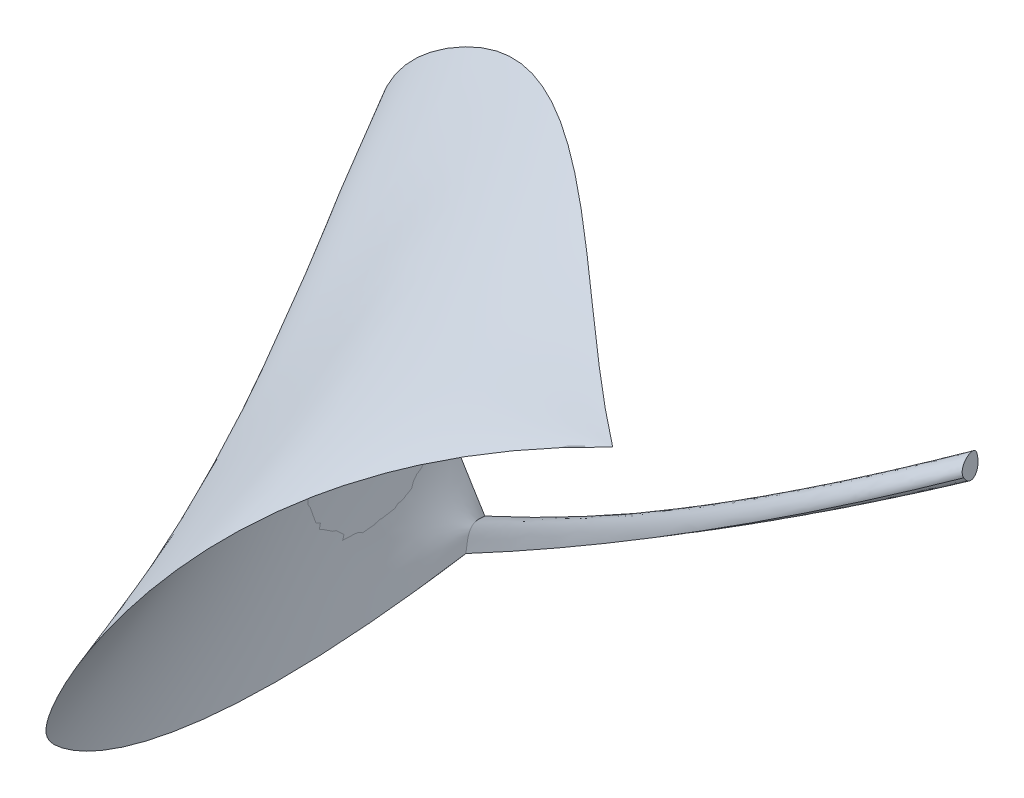
ISO-10303-21;
HEADER;
FILE_DESCRIPTION(('STEP AP214'),'2;1');
FILE_NAME('part.step','',(''),(''),'','','');
FILE_SCHEMA(('AUTOMOTIVE_DESIGN { 1 0 10303 214 1 1 1 1 }'));
ENDSEC;
DATA;
#1=APPLICATION_CONTEXT('core data for automotive mechanical design processes');
#2=APPLICATION_PROTOCOL_DEFINITION('international standard','automotive_design',2000,#1);
#3=PRODUCT_CONTEXT('',#1,'mechanical');
#4=PRODUCT('Part','Part','',(#3));
#5=PRODUCT_RELATED_PRODUCT_CATEGORY('part','',(#4));
#6=PRODUCT_DEFINITION_FORMATION('','',#4);
#7=PRODUCT_DEFINITION_CONTEXT('part definition',#1,'design');
#8=PRODUCT_DEFINITION('design','',#6,#7);
#9=PRODUCT_DEFINITION_SHAPE('','',#8);
#10=(LENGTH_UNIT() NAMED_UNIT(*) SI_UNIT(.MILLI.,.METRE.));
#11=(NAMED_UNIT(*) PLANE_ANGLE_UNIT() SI_UNIT($,.RADIAN.));
#12=(NAMED_UNIT(*) SI_UNIT($,.STERADIAN.) SOLID_ANGLE_UNIT());
#13=UNCERTAINTY_MEASURE_WITH_UNIT(LENGTH_MEASURE(1.E-05),#10,'distance_accuracy_value','');
#14=(GEOMETRIC_REPRESENTATION_CONTEXT(3) GLOBAL_UNCERTAINTY_ASSIGNED_CONTEXT((#13)) GLOBAL_UNIT_ASSIGNED_CONTEXT((#10,
#11,#12)) REPRESENTATION_CONTEXT('',''));
#15=CARTESIAN_POINT('',(0.,0.,0.));
#16=DIRECTION('',(0.,0.,1.));
#17=DIRECTION('',(1.,0.,0.));
#18=AXIS2_PLACEMENT_3D('',#15,#16,#17);
#19=CARTESIAN_POINT('',(476.173938751222,483.390649414063,2912.85863647461));
#20=CARTESIAN_POINT('',(468.505709833386,484.203110736505,2907.15012274566));
#21=CARTESIAN_POINT('',(453.033481909104,485.837551941291,2895.33620770903));
#22=CARTESIAN_POINT('',(413.746130360141,489.888925090577,2864.05863449965));
#23=CARTESIAN_POINT('',(357.24664169793,495.233100429992,2816.06685864888));
#24=CARTESIAN_POINT('',(299.472334646735,499.112690307353,2764.97149674455));
#25=CARTESIAN_POINT('',(258.0602857828,500.723087686551,2728.52128011258));
#26=CARTESIAN_POINT('',(224.932607896236,501.494553593436,2699.57399809323));
#27=CARTESIAN_POINT('',(183.638880068602,501.391244675883,2664.15338506051));
#28=CARTESIAN_POINT('',(142.761434191307,499.650929551684,2630.59425964772));
#29=CARTESIAN_POINT('',(110.46632020542,497.148383045274,2605.36995286823));
#30=CARTESIAN_POINT('',(78.4864498025541,493.874200141388,2581.36767607761));
#31=CARTESIAN_POINT('',(39.1852218403628,488.275703029805,2553.9187006092));
#32=CARTESIAN_POINT('',(0.953834645265467,480.566643990647,2530.41320071608));
#33=CARTESIAN_POINT('',(-28.8863542234126,473.07133723161,2514.29787507606));
#34=CARTESIAN_POINT('',(-56.3730886695851,465.205160417476,2500.94021452222));
#35=CARTESIAN_POINT('',(-88.5135090300193,454.365531427592,2487.91442288324));
#36=CARTESIAN_POINT('',(-114.351825196399,443.83714417721,2480.39678925414));
#37=CARTESIAN_POINT('',(-129.51334872772,437.003889742522,2477.08242398293));
#38=CARTESIAN_POINT('',(-142.052251947714,431.209692279449,2474.55640005456));
#39=CARTESIAN_POINT('',(-161.673827046332,421.377449022925,2471.63189144479));
#40=CARTESIAN_POINT('',(-179.54385515046,411.018525402232,2470.01286469059));
#41=CARTESIAN_POINT('',(-189.299999342797,404.857033905543,2469.26934460274));
#42=CARTESIAN_POINT('',(-199.008037796242,398.63548770122,2468.55118801729));
#43=CARTESIAN_POINT('',(-215.460220647931,387.138035879024,2467.52807505389));
#44=CARTESIAN_POINT('',(-231.786373332711,373.597734733701,2466.33827430998));
#45=CARTESIAN_POINT('',(-242.142332427982,363.921554121519,2465.25085156375));
#46=CARTESIAN_POINT('',(-249.227535176112,356.954046877819,2464.40066239642));
#47=CARTESIAN_POINT('',(-257.663767860382,347.995832185281,2463.18608081423));
#48=CARTESIAN_POINT('',(-272.38362987903,330.707784822725,2460.58869137601));
#49=CARTESIAN_POINT('',(-289.848760157672,305.969585880149,2456.36098661491));
#50=CARTESIAN_POINT('',(-307.441547822391,272.895625026125,2450.18457020366));
#51=CARTESIAN_POINT('',(-320.712504764034,238.514388582167,2443.62687976982));
#52=CARTESIAN_POINT('',(-329.746723163852,203.241643269208,2437.05900409462));
#53=CARTESIAN_POINT('',(-334.629295203094,167.493155808182,2430.85203195927));
#54=CARTESIAN_POINT('',(-335.400356970632,131.622947940912,2425.32820742179));
#55=CARTESIAN_POINT('',(-332.100044555339,95.9850414092217,2420.8097745402));
#56=CARTESIAN_POINT('',(-324.732151350591,60.8965301585065,2417.5915948032));
#57=CARTESIAN_POINT('',(-313.300470749763,26.6745081341629,2415.96852969952));
#58=CARTESIAN_POINT('',(-297.776844515171,-6.38368683068465,2416.22321465099));
#59=CARTESIAN_POINT('',(-278.133114409134,-37.9807169029118,2418.63828507944));
#60=CARTESIAN_POINT('',(-250.341694008074,-72.7997749031083,2424.3057263383));
#61=CARTESIAN_POINT('',(-211.521952543034,-109.187848150838,2435.32461415057));
#62=CARTESIAN_POINT('',(-175.841260413205,-132.739734612969,2448.34660754523));
#63=CARTESIAN_POINT('',(-156.306047916412,-143.412249183655,2456.21461029053));
#64=CARTESIAN_POINT('',(476.173938751222,483.390649414063,2912.85863647461));
#65=CARTESIAN_POINT('',(469.642135263237,482.759079949517,2915.94877733586));
#66=CARTESIAN_POINT('',(456.694416895408,481.291821808552,2921.77656390022));
#67=CARTESIAN_POINT('',(424.893581438018,476.620828522513,2934.6861256901));
#68=CARTESIAN_POINT('',(381.933349871931,467.323158460016,2948.39897853194));
#69=CARTESIAN_POINT('',(341.218085590919,454.154562043677,2956.96766524415));
#70=CARTESIAN_POINT('',(313.158862275321,443.032024834568,2961.30361681796));
#71=CARTESIAN_POINT('',(291.113394848481,433.470502362832,2964.14127370116));
#72=CARTESIAN_POINT('',(264.29639642581,420.31779931527,2966.66010759687));
#73=CARTESIAN_POINT('',(238.404258140923,405.712227245134,2968.13617048407));
#74=CARTESIAN_POINT('',(218.208510989653,393.244966728249,2968.88828535022));
#75=CARTESIAN_POINT('',(198.340193639671,380.292981106576,2969.40110891723));
#76=CARTESIAN_POINT('',(174.085204361226,363.263783512495,2969.68071530871));
#77=CARTESIAN_POINT('',(150.482441039877,345.33757026863,2969.60318032473));
#78=CARTESIAN_POINT('',(131.918575604085,330.591553347391,2969.40172114081));
#79=CARTESIAN_POINT('',(114.684930565159,316.562165148661,2969.12847356499));
#80=CARTESIAN_POINT('',(94.2371930725214,299.468112128302,2968.66591224566));
#81=CARTESIAN_POINT('',(77.3419514306096,285.109591983661,2968.10319611095));
#82=CARTESIAN_POINT('',(67.2193242048011,276.510772239105,2967.69299350195));
#83=CARTESIAN_POINT('',(58.8021431826666,269.359391351789,2967.32474843405));
#84=CARTESIAN_POINT('',(45.3865601969555,257.943732721241,2966.53484479824));
#85=CARTESIAN_POINT('',(32.7386018684828,246.969432783721,2965.1202727108));
#86=CARTESIAN_POINT('',(25.6834917852224,240.723644205296,2964.0126752119));
#87=CARTESIAN_POINT('',(18.6366488267479,234.462398873905,2962.84974905185));
#88=CARTESIAN_POINT('',(6.41754830999424,223.355482945824,2960.22889793348));
#89=CARTESIAN_POINT('',(-6.2720187751496,211.076854776003,2956.04958166055));
#90=CARTESIAN_POINT('',(-14.5872409129912,202.587412292663,2952.54247447741));
#91=CARTESIAN_POINT('',(-20.3617264110442,196.553191624154,2949.87131076152));
#92=CARTESIAN_POINT('',(-27.4012014768021,188.933539683985,2946.17631470836));
#93=CARTESIAN_POINT('',(-40.1061368992781,174.551077434965,2938.42862609078));
#94=CARTESIAN_POINT('',(-56.2880201900072,154.71631249755,2925.88715868308));
#95=CARTESIAN_POINT('',(-74.8396082963387,129.378753942014,2906.69076723597));
#96=CARTESIAN_POINT('',(-91.5623572313131,104.055016809948,2884.5090842506));
#97=CARTESIAN_POINT('',(-106.475145957909,78.9737996385338,2859.6550734035));
#98=CARTESIAN_POINT('',(-119.596853439105,54.3638009649498,2832.44169837123));
#99=CARTESIAN_POINT('',(-130.916386047768,30.4125457076055,2803.14938101734));
#100=CARTESIAN_POINT('',(-140.422650156765,7.30755878490972,2772.05854320542));
#101=CARTESIAN_POINT('',(-148.080323531447,-14.7882541990217,2739.43135336069));
#102=CARTESIAN_POINT('',(-153.854083937162,-35.7119876400732,2705.52997990839));
#103=CARTESIAN_POINT('',(-157.687308058339,-55.3139066405294,2670.60844049043));
#104=CARTESIAN_POINT('',(-159.523372579403,-73.4442763026749,2634.9207527487));
#105=CARTESIAN_POINT('',(-159.246637022034,-92.7098377916495,2592.6874099163));
#106=CARTESIAN_POINT('',(-155.348079055867,-111.790100437581,2543.98991159866));
#107=CARTESIAN_POINT('',(-148.97254913541,-123.115933463436,2507.6734334332));
#108=CARTESIAN_POINT('',(-144.864993422759,-127.947610427468,2489.71545181571));
#109=CARTESIAN_POINT('',(476.173938751222,483.390649414063,2912.85863647461));
#110=CARTESIAN_POINT('',(466.337999846936,484.207594050574,2914.92977934623));
#111=CARTESIAN_POINT('',(447.033669343258,485.423726339947,2918.76396235195));
#112=CARTESIAN_POINT('',(400.562813473588,486.461284957744,2926.87404639722));
#113=CARTESIAN_POINT('',(340.381787168893,482.546941002207,2934.27951095974));
#114=CARTESIAN_POINT('',(286.937136088313,471.687401678711,2936.63488257695));
#115=CARTESIAN_POINT('',(251.693572258834,461.149634683244,2936.32814504674));
#116=CARTESIAN_POINT('',(224.633710075655,451.680283746791,2935.33953610248));
#117=CARTESIAN_POINT('',(192.866700441423,438.03254494565,2932.80856334301));
#118=CARTESIAN_POINT('',(163.643554578115,422.352727880491,2928.77016467277));
#119=CARTESIAN_POINT('',(141.671419936784,408.819220416001,2924.76670390696));
#120=CARTESIAN_POINT('',(120.594114037856,394.706225926651,2920.28243241709));
#121=CARTESIAN_POINT('',(95.8451118865636,376.128973737193,2913.83998012654));
#122=CARTESIAN_POINT('',(72.9963590509075,356.723232537468,2906.39917509905));
#123=CARTESIAN_POINT('',(55.7195517832523,340.953260027585,2899.91819813532));
#124=CARTESIAN_POINT('',(40.1027766646071,326.097296765227,2893.52405576166));
#125=CARTESIAN_POINT('',(22.2438975203649,308.286862198106,2885.34578090786));
#126=CARTESIAN_POINT('',(8.14746176966954,293.721788755721,2878.00748832254));
#127=CARTESIAN_POINT('',(-0.0919081643549393,285.166576449506,2873.42958754035));
#128=CARTESIAN_POINT('',(-6.90170017177308,278.08678709689,2869.57953182453));
#129=CARTESIAN_POINT('',(-17.5483660189266,266.971188161614,2863.18808726608));
#130=CARTESIAN_POINT('',(-27.2726487824396,256.501786149859,2856.7510537575));
#131=CARTESIAN_POINT('',(-32.6045231278547,250.583344748383,2853.03065331535));
#132=CARTESIAN_POINT('',(-37.9144156272128,244.656792317912,2849.291719814));
#133=CARTESIAN_POINT('',(-46.9607380267791,234.208703415257,2842.56595934658));
#134=CARTESIAN_POINT('',(-56.0750650856994,222.73374283549,2835.06940039952));
#135=CARTESIAN_POINT('',(-61.9388538208588,214.808590912013,2829.91370184539));
#136=CARTESIAN_POINT('',(-65.9774461735689,209.17529086273,2826.26305818069));
#137=CARTESIAN_POINT('',(-70.8380417254052,202.056437003868,2821.69019818733));
#138=CARTESIAN_POINT('',(-79.4590980903844,188.597089740454,2813.12159203442));
#139=CARTESIAN_POINT('',(-90.0715980703959,169.959046061205,2801.38971422535));
#140=CARTESIAN_POINT('',(-101.632930301953,145.933083375915,2786.26695159768));
#141=CARTESIAN_POINT('',(-111.504496201717,121.62387066617,2770.7264372535));
#142=CARTESIAN_POINT('',(-119.820032184561,97.1975127824225,2754.62519766178));
#143=CARTESIAN_POINT('',(-126.71327466536,72.8201145751238,2737.82025929149));
#144=CARTESIAN_POINT('',(-132.30297097114,48.6371786362943,2720.15240970891));
#145=CARTESIAN_POINT('',(-136.707868428928,24.7942075579541,2701.46243648027));
#146=CARTESIAN_POINT('',(-140.034599846215,1.42439309996365,2681.58200286444));
#147=CARTESIAN_POINT('',(-142.389798030491,-21.3390729778163,2660.34277212031));
#148=CARTESIAN_POINT('',(-143.869445258458,-43.369584216054,2637.57233200697));
#149=CARTESIAN_POINT('',(-144.569523806817,-64.540534155418,2613.09827028352));
#150=CARTESIAN_POINT('',(-144.577399265926,-88.091927587806,2582.35638139313));
#151=CARTESIAN_POINT('',(-143.574587073846,-113.160270350934,2543.80840092659));
#152=CARTESIAN_POINT('',(-142.077732061299,-130.012035598067,2511.44795641824));
#153=CARTESIAN_POINT('',(-141.184589482057,-137.878867784223,2494.31124304657));
#154=CARTESIAN_POINT('',(476.173938751222,483.390649414063,2912.85863647461));
#155=CARTESIAN_POINT('',(465.744334788649,483.442972077871,2922.83131840703));
#156=CARTESIAN_POINT('',(445.504332865149,482.916222650063,2942.51297195493));
#157=CARTESIAN_POINT('',(397.887740307326,478.619897388304,2990.33302180642));
#158=CARTESIAN_POINT('',(339.262735308529,464.759639121247,3053.22216553347));
#159=CARTESIAN_POINT('',(291.276084088119,441.368052765625,3109.1972137724));
#160=CARTESIAN_POINT('',(261.390081160938,421.186180689593,3145.49377114368));
#161=CARTESIAN_POINT('',(239.147255279584,403.793262067974,3173.00434332707));
#162=CARTESIAN_POINT('',(214.298502267376,379.979482268773,3204.43174708688));
#163=CARTESIAN_POINT('',(192.938983076638,354.112285013837,3231.64926920261));
#164=CARTESIAN_POINT('',(177.674624838223,332.612531480747,3250.74007809784));
#165=CARTESIAN_POINT('',(163.535677492029,310.717464027589,3267.98965642856));
#166=CARTESIAN_POINT('',(147.803212762396,282.873697172316,3286.00102572175));
#167=CARTESIAN_POINT('',(134.208570333049,255.106773020882,3299.01612966996));
#168=CARTESIAN_POINT('',(124.34526758743,233.365390975404,3306.27317731074));
#169=CARTESIAN_POINT('',(115.646833807269,213.410716794282,3311.05602932914));
#170=CARTESIAN_POINT('',(105.974425618012,190.390171491897,3313.38100265104));
#171=CARTESIAN_POINT('',(98.4665386876741,172.598347738697,3311.5430830494));
#172=CARTESIAN_POINT('',(94.0621907462406,162.541356280505,3309.09310523224));
#173=CARTESIAN_POINT('',(90.4162267049695,154.303246778601,3306.77517441955));
#174=CARTESIAN_POINT('',(84.6733544733393,141.814160462847,3301.6238578629));
#175=CARTESIAN_POINT('',(79.3148161887641,130.746001862868,3294.7147573831));
#176=CARTESIAN_POINT('',(76.3264199212459,124.69259486928,3290.30590228014));
#177=CARTESIAN_POINT('',(73.3412778567428,118.665375997173,3285.80730801036));
#178=CARTESIAN_POINT('',(68.1588128526832,108.394564643395,3277.03179883767));
#179=CARTESIAN_POINT('',(62.7089038131716,97.7479862079567,3266.25297793683));
#180=CARTESIAN_POINT('',(59.0827365691608,90.6312191115006,3258.56074625778));
#181=CARTESIAN_POINT('',(56.5470489636665,85.6391014949011,3253.03123033624));
#182=CARTESIAN_POINT('',(53.4220407338462,79.4472988254145,3245.95113592089));
#183=CARTESIAN_POINT('',(47.6879432184144,68.0126921710305,3232.29284161674));
#184=CARTESIAN_POINT('',(40.1236489731452,52.8091068405284,3212.5981124319));
#185=CARTESIAN_POINT('',(30.8300896778912,34.1949163984109,3185.35932678212));
#186=CARTESIAN_POINT('',(21.659231836903,16.1829969344864,3155.52656073808));
#187=CARTESIAN_POINT('',(12.4723271247936,-1.21410903756543,3122.86580883042));
#188=CARTESIAN_POINT('',(3.13062721617635,-17.9838590040651,3087.14306558973));
#189=CARTESIAN_POINT('',(-6.50461062875397,-34.1137413494254,3048.12438955414));
#190=CARTESIAN_POINT('',(-16.5721291498025,-49.5912444580592,3005.57583926178));
#191=CARTESIAN_POINT('',(-27.2106706552185,-64.4038590644049,2959.26347807434));
#192=CARTESIAN_POINT('',(-38.5589774532514,-78.5390759029012,2908.95336935352));
#193=CARTESIAN_POINT('',(-50.7557918714955,-91.9843856026441,2854.41157624482));
#194=CARTESIAN_POINT('',(-63.9398562375452,-104.72727879273,2795.4041618937));
#195=CARTESIAN_POINT('',(-80.6349223283753,-118.759907270745,2721.07936060219));
#196=CARTESIAN_POINT('',(-101.822888891854,-133.584804731953,2627.9142386772));
#197=CARTESIAN_POINT('',(-119.923135991431,-143.584178673427,2550.11379648812));
#198=CARTESIAN_POINT('',(-129.603620147705,-148.297004318237,2509.10033569336));
#199=B_SPLINE_SURFACE_WITH_KNOTS('',3,3,((#19,#20,#21,#22,#23,#24,#25,#26,#27,#28,#29,#30,#31,
#32,#33,#34,#35,#36,#37,#38,#39,#40,#41,#42,#43,#44,#45,#46,#47,#48,#49,#50,#51,#52,#53,#54,#55,
#56,#57,#58,#59,#60,#61,#62,#63),(#64,#65,#66,#67,#68,#69,#70,#71,#72,#73,#74,#75,#76,#77,#78,
#79,#80,#81,#82,#83,#84,#85,#86,#87,#88,#89,#90,#91,#92,#93,#94,#95,#96,#97,#98,#99,#100,#101,
#102,#103,#104,#105,#106,#107,#108),(#109,#110,#111,#112,#113,#114,#115,#116,#117,#118,#119,
#120,#121,#122,#123,#124,#125,#126,#127,#128,#129,#130,#131,#132,#133,#134,#135,#136,#137,#138,
#139,#140,#141,#142,#143,#144,#145,#146,#147,#148,#149,#150,#151,#152,#153),(#154,#155,#156,
#157,#158,#159,#160,#161,#162,#163,#164,#165,#166,#167,#168,#169,#170,#171,#172,#173,#174,#175,
#176,#177,#178,#179,#180,#181,#182,#183,#184,#185,#186,#187,#188,#189,#190,#191,#192,#193,#194,
#195,#196,#197,#198)),.UNSPECIFIED.,.F.,.F.,.F.,(4,4),(4,1,1,1,1,1,1,1,1,1,1,1,1,1,1,1,1,1,1,1,
1,1,1,1,1,1,1,1,1,1,1,1,1,1,1,1,1,1,1,1,1,1,4),(0.,1.),(0.,0.015625,0.03125,0.078125,0.125,
0.140625,0.15625,0.1875,0.21875,0.234375,0.25,0.28125,0.3125,0.328125,0.34375,0.37109375,
0.3984375,0.40234375,0.40625,0.427691642031946,0.449133284063892,0.451129142031946,0.453125,
0.474609375,0.49609375,0.501953125,0.5078125,0.51953125,0.53125,0.5625,0.59375,0.625,0.65625,
0.6875,0.71875,0.75,0.78125,0.8125,0.84375,0.875,0.90625,0.953125,1.),.UNSPECIFIED.);
#200=CARTESIAN_POINT('',(476.173938751221,483.390649414062,2912.85863647461));
#201=CARTESIAN_POINT('',(465.744334788649,483.442972077871,2922.83131840703));
#202=CARTESIAN_POINT('',(445.504332865149,482.916222650063,2942.51297195493));
#203=CARTESIAN_POINT('',(397.887740307326,478.619897388304,2990.33302180642));
#204=CARTESIAN_POINT('',(339.262735308529,464.759639121247,3053.22216553347));
#205=CARTESIAN_POINT('',(291.276084088119,441.368052765625,3109.1972137724));
#206=CARTESIAN_POINT('',(261.390081160938,421.186180689593,3145.49377114368));
#207=CARTESIAN_POINT('',(239.147255279584,403.793262067974,3173.00434332707));
#208=CARTESIAN_POINT('',(214.298502267376,379.979482268773,3204.43174708688));
#209=CARTESIAN_POINT('',(192.938983076638,354.112285013837,3231.64926920261));
#210=CARTESIAN_POINT('',(177.674624838223,332.612531480747,3250.74007809784));
#211=CARTESIAN_POINT('',(163.535677492029,310.717464027589,3267.98965642856));
#212=CARTESIAN_POINT('',(147.803212762396,282.873697172316,3286.00102572175));
#213=CARTESIAN_POINT('',(134.208570333049,255.106773020882,3299.01612966996));
#214=CARTESIAN_POINT('',(124.34526758743,233.365390975404,3306.27317731074));
#215=CARTESIAN_POINT('',(115.646833807269,213.410716794282,3311.05602932914));
#216=CARTESIAN_POINT('',(105.974425618012,190.390171491897,3313.38100265104));
#217=CARTESIAN_POINT('',(98.4665386876741,172.598347738697,3311.5430830494));
#218=CARTESIAN_POINT('',(94.0621907462406,162.541356280505,3309.09310523224));
#219=CARTESIAN_POINT('',(90.4162267049695,154.303246778601,3306.77517441955));
#220=CARTESIAN_POINT('',(84.6733544733393,141.814160462847,3301.6238578629));
#221=CARTESIAN_POINT('',(79.3148161887641,130.746001862868,3294.7147573831));
#222=CARTESIAN_POINT('',(76.3264199212459,124.69259486928,3290.30590228014));
#223=CARTESIAN_POINT('',(73.3412778567428,118.665375997173,3285.80730801036));
#224=CARTESIAN_POINT('',(68.1588128526832,108.394564643395,3277.03179883767));
#225=CARTESIAN_POINT('',(62.7089038131716,97.7479862079567,3266.25297793683));
#226=CARTESIAN_POINT('',(59.0827365691608,90.6312191115006,3258.56074625778));
#227=CARTESIAN_POINT('',(56.5470489636665,85.6391014949011,3253.03123033624));
#228=CARTESIAN_POINT('',(53.4220407338462,79.4472988254145,3245.95113592089));
#229=CARTESIAN_POINT('',(47.6879432184144,68.0126921710305,3232.29284161674));
#230=CARTESIAN_POINT('',(40.1236489731452,52.8091068405284,3212.5981124319));
#231=CARTESIAN_POINT('',(30.8300896778912,34.1949163984109,3185.35932678212));
#232=CARTESIAN_POINT('',(21.659231836903,16.1829969344864,3155.52656073808));
#233=CARTESIAN_POINT('',(12.4723271247936,-1.21410903756543,3122.86580883042));
#234=CARTESIAN_POINT('',(3.13062721617635,-17.9838590040651,3087.14306558973));
#235=CARTESIAN_POINT('',(-6.50461062875397,-34.1137413494254,3048.12438955414));
#236=CARTESIAN_POINT('',(-16.5721291498025,-49.5912444580592,3005.57583926178));
#237=CARTESIAN_POINT('',(-27.2106706552185,-64.4038590644049,2959.26347807434));
#238=CARTESIAN_POINT('',(-38.5589774532514,-78.5390759029012,2908.95336935352));
#239=CARTESIAN_POINT('',(-50.7557918714955,-91.9843856026441,2854.41157624482));
#240=CARTESIAN_POINT('',(-63.9398562375452,-104.72727879273,2795.4041618937));
#241=CARTESIAN_POINT('',(-80.6349223283753,-118.759907270745,2721.07936060219));
#242=CARTESIAN_POINT('',(-101.822888891854,-133.584804731953,2627.9142386772));
#243=CARTESIAN_POINT('',(-119.923135991431,-143.584178673427,2550.11379648812));
#244=CARTESIAN_POINT('',(-129.603620147705,-148.297004318237,2509.10033569336));
#245=B_SPLINE_CURVE_WITH_KNOTS('',3,(#200,#201,#202,#203,#204,#205,#206,#207,#208,#209,#210,
#211,#212,#213,#214,#215,#216,#217,#218,#219,#220,#221,#222,#223,#224,#225,#226,#227,#228,#229,
#230,#231,#232,#233,#234,#235,#236,#237,#238,#239,#240,#241,#242,#243,#244),.UNSPECIFIED.,.F.,
.F.,(4,1,1,1,1,1,1,1,1,1,1,1,1,1,1,1,1,1,1,1,1,1,1,1,1,1,1,1,1,1,1,1,1,1,1,1,1,1,1,1,1,1,4),(0.,
0.015625,0.03125,0.078125,0.125,0.140625,0.15625,0.1875,0.21875,0.234375,0.25,0.28125,0.3125,
0.328125,0.34375,0.37109375,0.3984375,0.40234375,0.40625,0.427691642031946,0.449133284063892,
0.451129142031946,0.453125,0.474609375,0.49609375,0.501953125,0.5078125,0.51953125,0.53125,
0.5625,0.59375,0.625,0.65625,0.6875,0.71875,0.75,0.78125,0.8125,0.84375,0.875,0.90625,0.953125,
1.),.UNSPECIFIED.);
#246=CARTESIAN_POINT('',(-129.603620147705,-148.297004318237,2509.10033569336));
#247=VERTEX_POINT('',#246);
#248=CARTESIAN_POINT('',(476.173938751221,483.390649414062,2912.85863647461));
#249=VERTEX_POINT('',#248);
#250=EDGE_CURVE('E85',#247,#249,#245,.F.);
#251=CARTESIAN_POINT('',(-156.306047916412,-143.412249183655,2456.21461029053));
#252=CARTESIAN_POINT('',(-144.864993422759,-127.947610427468,2489.71545181571));
#253=CARTESIAN_POINT('',(-141.184589482057,-137.878867784223,2494.31124304657));
#254=CARTESIAN_POINT('',(-129.603620147705,-148.297004318237,2509.10033569336));
#255=B_SPLINE_CURVE_WITH_KNOTS('',3,(#251,#252,#253,#254),.UNSPECIFIED.,.F.,.F.,(4,4),(0.,1.),.UNSPECIFIED.);
#256=CARTESIAN_POINT('',(-156.306047916412,-143.412249183655,2456.21461029053));
#257=VERTEX_POINT('',#256);
#258=EDGE_CURVE('E129',#257,#247,#255,.T.);
#259=CARTESIAN_POINT('',(476.173938751221,483.390649414062,2912.85863647461));
#260=CARTESIAN_POINT('',(468.505709833386,484.203110736505,2907.15012274566));
#261=CARTESIAN_POINT('',(453.033481909104,485.837551941291,2895.33620770903));
#262=CARTESIAN_POINT('',(413.746130360141,489.888925090577,2864.05863449965));
#263=CARTESIAN_POINT('',(357.24664169793,495.233100429992,2816.06685864888));
#264=CARTESIAN_POINT('',(299.472334646735,499.112690307353,2764.97149674455));
#265=CARTESIAN_POINT('',(258.0602857828,500.723087686551,2728.52128011258));
#266=CARTESIAN_POINT('',(224.932607896236,501.494553593436,2699.57399809323));
#267=CARTESIAN_POINT('',(183.638880068602,501.391244675883,2664.15338506051));
#268=CARTESIAN_POINT('',(142.761434191307,499.650929551684,2630.59425964772));
#269=CARTESIAN_POINT('',(110.46632020542,497.148383045274,2605.36995286823));
#270=CARTESIAN_POINT('',(78.4864498025541,493.874200141388,2581.36767607761));
#271=CARTESIAN_POINT('',(39.1852218403628,488.275703029805,2553.9187006092));
#272=CARTESIAN_POINT('',(0.953834645265467,480.566643990647,2530.41320071608));
#273=CARTESIAN_POINT('',(-28.8863542234126,473.07133723161,2514.29787507606));
#274=CARTESIAN_POINT('',(-56.3730886695851,465.205160417476,2500.94021452222));
#275=CARTESIAN_POINT('',(-88.5135090300193,454.365531427592,2487.91442288324));
#276=CARTESIAN_POINT('',(-114.351825196399,443.83714417721,2480.39678925414));
#277=CARTESIAN_POINT('',(-129.51334872772,437.003889742522,2477.08242398293));
#278=CARTESIAN_POINT('',(-142.052251947714,431.209692279449,2474.55640005456));
#279=CARTESIAN_POINT('',(-161.673827046332,421.377449022925,2471.63189144479));
#280=CARTESIAN_POINT('',(-179.54385515046,411.018525402232,2470.01286469059));
#281=CARTESIAN_POINT('',(-189.299999342797,404.857033905543,2469.26934460274));
#282=CARTESIAN_POINT('',(-199.008037796242,398.63548770122,2468.55118801729));
#283=CARTESIAN_POINT('',(-215.460220647931,387.138035879024,2467.52807505389));
#284=CARTESIAN_POINT('',(-231.786373332711,373.597734733701,2466.33827430998));
#285=CARTESIAN_POINT('',(-242.142332427982,363.921554121519,2465.25085156375));
#286=CARTESIAN_POINT('',(-249.227535176112,356.954046877819,2464.40066239642));
#287=CARTESIAN_POINT('',(-257.663767860382,347.995832185281,2463.18608081423));
#288=CARTESIAN_POINT('',(-272.38362987903,330.707784822725,2460.58869137601));
#289=CARTESIAN_POINT('',(-289.848760157672,305.969585880149,2456.36098661491));
#290=CARTESIAN_POINT('',(-307.441547822391,272.895625026125,2450.18457020366));
#291=CARTESIAN_POINT('',(-320.712504764034,238.514388582167,2443.62687976982));
#292=CARTESIAN_POINT('',(-329.746723163852,203.241643269208,2437.05900409462));
#293=CARTESIAN_POINT('',(-334.629295203094,167.493155808182,2430.85203195927));
#294=CARTESIAN_POINT('',(-335.400356970632,131.622947940912,2425.32820742179));
#295=CARTESIAN_POINT('',(-332.100044555339,95.9850414092217,2420.8097745402));
#296=CARTESIAN_POINT('',(-324.732151350591,60.8965301585065,2417.5915948032));
#297=CARTESIAN_POINT('',(-313.300470749763,26.6745081341629,2415.96852969952));
#298=CARTESIAN_POINT('',(-297.776844515171,-6.38368683068465,2416.22321465099));
#299=CARTESIAN_POINT('',(-278.133114409134,-37.9807169029118,2418.63828507944));
#300=CARTESIAN_POINT('',(-250.341694008074,-72.7997749031083,2424.3057263383));
#301=CARTESIAN_POINT('',(-211.521952543034,-109.187848150838,2435.32461415057));
#302=CARTESIAN_POINT('',(-175.841260413205,-132.739734612969,2448.34660754523));
#303=CARTESIAN_POINT('',(-156.306047916412,-143.412249183655,2456.21461029053));
#304=B_SPLINE_CURVE_WITH_KNOTS('',3,(#259,#260,#261,#262,#263,#264,#265,#266,#267,#268,#269,
#270,#271,#272,#273,#274,#275,#276,#277,#278,#279,#280,#281,#282,#283,#284,#285,#286,#287,#288,
#289,#290,#291,#292,#293,#294,#295,#296,#297,#298,#299,#300,#301,#302,#303),.UNSPECIFIED.,.F.,
.F.,(4,1,1,1,1,1,1,1,1,1,1,1,1,1,1,1,1,1,1,1,1,1,1,1,1,1,1,1,1,1,1,1,1,1,1,1,1,1,1,1,1,1,4),(0.,
0.015625,0.03125,0.078125,0.125,0.140625,0.15625,0.1875,0.21875,0.234375,0.25,0.28125,0.3125,
0.328125,0.34375,0.37109375,0.3984375,0.40234375,0.40625,0.427691642031946,0.449133284063892,
0.451129142031946,0.453125,0.474609375,0.49609375,0.501953125,0.5078125,0.51953125,0.53125,
0.5625,0.59375,0.625,0.65625,0.6875,0.71875,0.75,0.78125,0.8125,0.84375,0.875,0.90625,0.953125,
1.),.UNSPECIFIED.);
#305=EDGE_CURVE('E124',#249,#257,#304,.T.);
#306=ORIENTED_EDGE('',*,*,#250,.F.);
#307=ORIENTED_EDGE('',*,*,#258,.F.);
#308=ORIENTED_EDGE('',*,*,#305,.F.);
#309=EDGE_LOOP('',(#306,#307,#308));
#310=FACE_BOUND('',#309,.T.);
#311=ADVANCED_FACE('F80',(#310),#199,.T.);
#312=CARTESIAN_POINT('',(476.173938751221,483.390649414062,2912.85863647461));
#313=CARTESIAN_POINT('',(465.744334788649,483.442972077871,2922.83131840703));
#314=CARTESIAN_POINT('',(445.504332865149,482.916222650063,2942.51297195493));
#315=CARTESIAN_POINT('',(397.887740307326,478.619897388304,2990.33302180642));
#316=CARTESIAN_POINT('',(339.262735308529,464.759639121247,3053.22216553347));
#317=CARTESIAN_POINT('',(291.276084088119,441.368052765625,3109.1972137724));
#318=CARTESIAN_POINT('',(261.390081160938,421.186180689593,3145.49377114368));
#319=CARTESIAN_POINT('',(239.147255279584,403.793262067974,3173.00434332707));
#320=CARTESIAN_POINT('',(214.298502267376,379.979482268773,3204.43174708688));
#321=CARTESIAN_POINT('',(192.938983076638,354.112285013837,3231.64926920261));
#322=CARTESIAN_POINT('',(177.674624838223,332.612531480747,3250.74007809784));
#323=CARTESIAN_POINT('',(163.535677492029,310.717464027589,3267.98965642856));
#324=CARTESIAN_POINT('',(147.803212762396,282.873697172316,3286.00102572175));
#325=CARTESIAN_POINT('',(134.208570333049,255.106773020882,3299.01612966996));
#326=CARTESIAN_POINT('',(124.34526758743,233.365390975404,3306.27317731074));
#327=CARTESIAN_POINT('',(115.646833807269,213.410716794282,3311.05602932914));
#328=CARTESIAN_POINT('',(105.974425618012,190.390171491897,3313.38100265104));
#329=CARTESIAN_POINT('',(98.4665386876741,172.598347738697,3311.5430830494));
#330=CARTESIAN_POINT('',(94.0621907462406,162.541356280505,3309.09310523224));
#331=CARTESIAN_POINT('',(90.4162267049695,154.303246778601,3306.77517441955));
#332=CARTESIAN_POINT('',(84.6733544733393,141.814160462847,3301.6238578629));
#333=CARTESIAN_POINT('',(79.3148161887641,130.746001862868,3294.7147573831));
#334=CARTESIAN_POINT('',(76.3264199212459,124.69259486928,3290.30590228014));
#335=CARTESIAN_POINT('',(73.3412778567428,118.665375997173,3285.80730801036));
#336=CARTESIAN_POINT('',(68.1588128526832,108.394564643395,3277.03179883767));
#337=CARTESIAN_POINT('',(62.7089038131716,97.7479862079567,3266.25297793683));
#338=CARTESIAN_POINT('',(59.0827365691608,90.6312191115006,3258.56074625778));
#339=CARTESIAN_POINT('',(56.5470489636665,85.6391014949011,3253.03123033624));
#340=CARTESIAN_POINT('',(53.4220407338462,79.4472988254145,3245.95113592089));
#341=CARTESIAN_POINT('',(47.6879432184144,68.0126921710305,3232.29284161674));
#342=CARTESIAN_POINT('',(40.1236489731452,52.8091068405284,3212.5981124319));
#343=CARTESIAN_POINT('',(30.8300896778912,34.1949163984109,3185.35932678212));
#344=CARTESIAN_POINT('',(21.659231836903,16.1829969344864,3155.52656073808));
#345=CARTESIAN_POINT('',(12.4723271247936,-1.21410903756543,3122.86580883042));
#346=CARTESIAN_POINT('',(3.13062721617635,-17.9838590040651,3087.14306558973));
#347=CARTESIAN_POINT('',(-6.50461062875397,-34.1137413494254,3048.12438955414));
#348=CARTESIAN_POINT('',(-16.5721291498025,-49.5912444580592,3005.57583926178));
#349=CARTESIAN_POINT('',(-27.2106706552185,-64.4038590644049,2959.26347807434));
#350=CARTESIAN_POINT('',(-38.5589774532514,-78.5390759029012,2908.95336935352));
#351=CARTESIAN_POINT('',(-50.7557918714955,-91.9843856026441,2854.41157624482));
#352=CARTESIAN_POINT('',(-63.9398562375452,-104.72727879273,2795.4041618937));
#353=CARTESIAN_POINT('',(-80.6349223283753,-118.759907270745,2721.07936060219));
#354=CARTESIAN_POINT('',(-101.822888891854,-133.584804731953,2627.9142386772));
#355=CARTESIAN_POINT('',(-119.923135991431,-143.584178673427,2550.11379648812));
#356=CARTESIAN_POINT('',(-129.603620147705,-148.297004318237,2509.10033569336));
#357=CARTESIAN_POINT('',(476.173938751221,483.390649414062,2912.85863647461));
#358=CARTESIAN_POINT('',(466.21410795721,484.587886704093,2915.34746404538));
#359=CARTESIAN_POINT('',(446.661993674079,486.564604300504,2920.01701644938));
#360=CARTESIAN_POINT('',(399.573043367601,489.498802066509,2930.21061325605));
#361=CARTESIAN_POINT('',(338.534328917587,488.212737849895,2940.50549557223));
#362=CARTESIAN_POINT('',(284.260654939986,479.880171758193,2945.64715952206));
#363=CARTESIAN_POINT('',(248.446772087529,471.070199732387,2947.2520590515));
#364=CARTESIAN_POINT('',(220.940482771097,462.948351112074,2947.75740246775));
#365=CARTESIAN_POINT('',(188.635914397655,450.912628415303,2947.02020914389));
#366=CARTESIAN_POINT('',(158.907970078905,436.729048589223,2944.6577322852));
#367=CARTESIAN_POINT('',(136.554928871858,424.311485710294,2941.9125086318));
#368=CARTESIAN_POINT('',(115.113096549099,411.25654637386,2938.62754544232));
#369=CARTESIAN_POINT('',(89.9411966517864,393.886084260256,2933.5663709032));
#370=CARTESIAN_POINT('',(66.7186864957628,375.51346483845,2927.33005719107));
#371=CARTESIAN_POINT('',(49.1756336555822,360.454210885613,2921.69481565559));
#372=CARTESIAN_POINT('',(33.3307522489175,346.188566390137,2916.01620618012));
#373=CARTESIAN_POINT('',(15.2353080059519,328.955177692963,2908.56287606187));
#374=CARTESIAN_POINT('',(0.984284650928717,314.720598962348,2901.67562729265));
#375=CARTESIAN_POINT('',(-7.33217433501561,306.308326713227,2897.31200212362));
#376=CARTESIAN_POINT('',(-14.2028230987127,299.335851589962,2893.62841143548));
#377=CARTESIAN_POINT('',(-24.9295832836165,288.330961212005,2887.44118815143));
#378=CARTESIAN_POINT('',(-34.7012364873155,277.863654635852,2881.09407577727));
#379=CARTESIAN_POINT('',(-40.0503760054022,271.912543755411,2877.39016947384));
#380=CARTESIAN_POINT('',(-45.375934261742,265.947511902708,2873.66189944289));
#381=CARTESIAN_POINT('',(-54.4330614783894,255.371976210242,2866.89435919052));
#382=CARTESIAN_POINT('',(-63.5269621798753,243.64496232287,2859.23673410983));
#383=CARTESIAN_POINT('',(-69.363513741109,235.501243326812,2853.92349282997));
#384=CARTESIAN_POINT('',(-73.3788889810477,229.699556405147,2850.14728506711));
#385=CARTESIAN_POINT('',(-78.2030682902063,222.344084641879,2845.39086640697));
#386=CARTESIAN_POINT('',(-86.7381809180245,208.379553920105,2836.41498065047));
#387=CARTESIAN_POINT('',(-97.190430298609,188.901771586569,2823.97346632228));
#388=CARTESIAN_POINT('',(-108.474552294146,163.550774909495,2807.68526364525));
#389=CARTESIAN_POINT('',(-117.999461562117,137.67109611837,2790.72947053655));
#390=CARTESIAN_POINT('',(-125.90423654784,111.447719455153,2772.98233182787));
#391=CARTESIAN_POINT('',(-132.327955696631,85.0656291618019,2754.3200923509));
#392=CARTESIAN_POINT('',(-137.394708365963,58.6892072218458,2734.60275803458));
#393=CARTESIAN_POINT('',(-141.228583913307,32.4828356188118,2713.69033480787));
#394=CARTESIAN_POINT('',(-143.941557176596,6.59858550406795,2691.43370429236));
#395=CARTESIAN_POINT('',(-145.645602993766,-18.8114719710176,2667.68374810961));
#396=CARTESIAN_POINT('',(-146.442045671962,-43.6018509556058,2642.28727238144));
#397=CARTESIAN_POINT('',(-146.43220951833,-67.6270655988574,2615.09108322963));
#398=CARTESIAN_POINT('',(-145.586921683043,-94.5965383461492,2581.08369331354));
#399=CARTESIAN_POINT('',(-143.582355573719,-123.665654426705,2538.70761986126));
#400=CARTESIAN_POINT('',(-141.32216555474,-143.5604782928,2503.43286429752));
#401=CARTESIAN_POINT('',(-140.047355472282,-152.948839788437,2484.83899539816));
#402=CARTESIAN_POINT('',(476.173938751221,483.390649414062,2912.85863647461));
#403=CARTESIAN_POINT('',(467.668566972679,483.999937848378,2912.54250281788));
#404=CARTESIAN_POINT('',(450.773712023733,485.014395505134,2911.5577403463));
#405=CARTESIAN_POINT('',(409.125810197136,486.533348910162,2907.47081351179));
#406=CARTESIAN_POINT('',(352.49602618223,485.821284517031,2897.58393248618));
#407=CARTESIAN_POINT('',(298.547486207663,480.937094902078,2883.28544860602));
#408=CARTESIAN_POINT('',(261.368324448298,475.502506270736,2871.84585034725));
#409=CARTESIAN_POINT('',(232.176486868251,470.388074477906,2862.31423191583));
#410=CARTESIAN_POINT('',(196.73815200783,462.57909273042,2849.89473115048));
#411=CARTESIAN_POINT('',(162.72327929121,452.973014682669,2837.26967454813));
#412=CARTESIAN_POINT('',(136.378365998765,444.264390289309,2827.32694444271));
#413=CARTESIAN_POINT('',(110.610183510616,434.898927152314,2817.56353062391));
#414=CARTESIAN_POINT('',(79.4789648154802,422.00865538639,2805.83505545464));
#415=CARTESIAN_POINT('',(49.7478750864638,407.705027054147,2795.00526166719));
#416=CARTESIAN_POINT('',(26.7799505305551,395.512850784513,2787.03921061202));
#417=CARTESIAN_POINT('',(5.74470763296827,383.651789045678,2780.03608061321));
#418=CARTESIAN_POINT('',(-18.6993456394879,368.769244959062,2772.44737634649));
#419=CARTESIAN_POINT('',(-38.2772521226525,355.806556856218,2767.03360636706));
#420=CARTESIAN_POINT('',(-49.7710841690859,347.880652669593,2764.11306495512));
#421=CARTESIAN_POINT('',(-59.279189957251,341.254642888294,2761.74001148019));
#422=CARTESIAN_POINT('',(-74.1772134413233,330.498112891267,2758.18419109821));
#423=CARTESIAN_POINT('',(-87.7988084257386,319.846546348595,2754.86934566729));
#424=CARTESIAN_POINT('',(-95.2598807829329,313.682991604711,2752.92967365537));
#425=CARTESIAN_POINT('',(-102.688583962201,307.487007675731,2750.97489062298));
#426=CARTESIAN_POINT('',(-115.32528414762,296.318280144189,2747.38691640847));
#427=CARTESIAN_POINT('',(-127.978873331172,283.634614077771,2742.97924168304));
#428=CARTESIAN_POINT('',(-136.066489213464,274.729500158249,2739.65795038997));
#429=CARTESIAN_POINT('',(-141.61957155396,268.359930438101,2737.21994075669));
#430=CARTESIAN_POINT('',(-148.269745177012,260.243391095928,2734.00536863826));
#431=CARTESIAN_POINT('',(-159.97453584267,244.744620832159,2727.61362600786));
#432=CARTESIAN_POINT('',(-174.135307641004,222.936608180798,2718.02692757642));
#433=CARTESIAN_POINT('',(-188.995654679632,194.32069001385,2704.47415374968));
#434=CARTESIAN_POINT('',(-200.970208569099,164.988888243048,2689.71084639836));
#435=CARTESIAN_POINT('',(-210.159152424524,135.226032561521,2673.91344935179));
#436=CARTESIAN_POINT('',(-216.662669361023,105.316952662398,2657.2584064393));
#437=CARTESIAN_POINT('',(-220.550969903602,75.5053046200342,2639.88961967727));
#438=CARTESIAN_POINT('',(-221.894264577267,46.0347445087875,2621.95099108206));
#439=CARTESIAN_POINT('',(-220.738535299507,17.1243090887213,2603.56816923169));
#440=CARTESIAN_POINT('',(-217.12976398781,-11.0069648801007,2584.86680270419));
#441=CARTESIAN_POINT('',(-211.092631478741,-38.1532113440152,2565.96438929427));
#442=CARTESIAN_POINT('',(-202.651818608867,-64.1085642493589,2546.97842679662));
#443=CARTESIAN_POINT('',(-190.005973385423,-92.7652182498219,2524.86752270259));
#444=CARTESIAN_POINT('',(-171.564769325905,-122.85881383148,2499.84969646485));
#445=CARTESIAN_POINT('',(-154.099320493123,-142.570941660012,2481.60014201552));
#446=CARTESIAN_POINT('',(-144.446805324308,-151.595766025384,2472.67562225609));
#447=CARTESIAN_POINT('',(476.173938751221,483.390649414062,2912.85863647461));
#448=CARTESIAN_POINT('',(468.505709833386,484.203110736505,2907.15012274566));
#449=CARTESIAN_POINT('',(453.033481909104,485.837551941291,2895.33620770903));
#450=CARTESIAN_POINT('',(413.746130360141,489.888925090577,2864.05863449965));
#451=CARTESIAN_POINT('',(357.24664169793,495.233100429992,2816.06685864888));
#452=CARTESIAN_POINT('',(299.472334646735,499.112690307353,2764.97149674455));
#453=CARTESIAN_POINT('',(258.0602857828,500.723087686551,2728.52128011258));
#454=CARTESIAN_POINT('',(224.932607896236,501.494553593436,2699.57399809323));
#455=CARTESIAN_POINT('',(183.638880068602,501.391244675883,2664.15338506051));
#456=CARTESIAN_POINT('',(142.761434191307,499.650929551684,2630.59425964772));
#457=CARTESIAN_POINT('',(110.46632020542,497.148383045274,2605.36995286823));
#458=CARTESIAN_POINT('',(78.4864498025541,493.874200141388,2581.36767607761));
#459=CARTESIAN_POINT('',(39.1852218403628,488.275703029805,2553.9187006092));
#460=CARTESIAN_POINT('',(0.953834645265467,480.566643990647,2530.41320071608));
#461=CARTESIAN_POINT('',(-28.8863542234126,473.07133723161,2514.29787507606));
#462=CARTESIAN_POINT('',(-56.3730886695851,465.205160417476,2500.94021452222));
#463=CARTESIAN_POINT('',(-88.5135090300193,454.365531427592,2487.91442288324));
#464=CARTESIAN_POINT('',(-114.351825196399,443.83714417721,2480.39678925414));
#465=CARTESIAN_POINT('',(-129.51334872772,437.003889742522,2477.08242398293));
#466=CARTESIAN_POINT('',(-142.052251947714,431.209692279449,2474.55640005456));
#467=CARTESIAN_POINT('',(-161.673827046332,421.377449022925,2471.63189144479));
#468=CARTESIAN_POINT('',(-179.54385515046,411.018525402232,2470.01286469059));
#469=CARTESIAN_POINT('',(-189.299999342797,404.857033905543,2469.26934460274));
#470=CARTESIAN_POINT('',(-199.008037796242,398.63548770122,2468.55118801729));
#471=CARTESIAN_POINT('',(-215.460220647931,387.138035879024,2467.52807505389));
#472=CARTESIAN_POINT('',(-231.786373332711,373.597734733701,2466.33827430998));
#473=CARTESIAN_POINT('',(-242.142332427982,363.921554121519,2465.25085156375));
#474=CARTESIAN_POINT('',(-249.227535176112,356.954046877819,2464.40066239642));
#475=CARTESIAN_POINT('',(-257.663767860382,347.995832185281,2463.18608081423));
#476=CARTESIAN_POINT('',(-272.38362987903,330.707784822725,2460.58869137601));
#477=CARTESIAN_POINT('',(-289.848760157672,305.969585880149,2456.36098661491));
#478=CARTESIAN_POINT('',(-307.441547822391,272.895625026125,2450.18457020366));
#479=CARTESIAN_POINT('',(-320.712504764034,238.514388582167,2443.62687976982));
#480=CARTESIAN_POINT('',(-329.746723163852,203.241643269208,2437.05900409462));
#481=CARTESIAN_POINT('',(-334.629295203094,167.493155808182,2430.85203195927));
#482=CARTESIAN_POINT('',(-335.400356970632,131.622947940912,2425.32820742179));
#483=CARTESIAN_POINT('',(-332.100044555339,95.9850414092217,2420.8097745402));
#484=CARTESIAN_POINT('',(-324.732151350591,60.8965301585065,2417.5915948032));
#485=CARTESIAN_POINT('',(-313.300470749763,26.6745081341629,2415.96852969952));
#486=CARTESIAN_POINT('',(-297.776844515171,-6.38368683068465,2416.22321465099));
#487=CARTESIAN_POINT('',(-278.133114409134,-37.9807169029118,2418.63828507944));
#488=CARTESIAN_POINT('',(-250.341694008074,-72.7997749031083,2424.3057263383));
#489=CARTESIAN_POINT('',(-211.521952543034,-109.187848150838,2435.32461415057));
#490=CARTESIAN_POINT('',(-175.841260413205,-132.739734612969,2448.34660754523));
#491=CARTESIAN_POINT('',(-156.306047916412,-143.412249183655,2456.21461029053));
#492=B_SPLINE_SURFACE_WITH_KNOTS('',3,3,((#312,#313,#314,#315,#316,#317,#318,#319,#320,#321,
#322,#323,#324,#325,#326,#327,#328,#329,#330,#331,#332,#333,#334,#335,#336,#337,#338,#339,#340,
#341,#342,#343,#344,#345,#346,#347,#348,#349,#350,#351,#352,#353,#354,#355,#356),(#357,#358,
#359,#360,#361,#362,#363,#364,#365,#366,#367,#368,#369,#370,#371,#372,#373,#374,#375,#376,#377,
#378,#379,#380,#381,#382,#383,#384,#385,#386,#387,#388,#389,#390,#391,#392,#393,#394,#395,#396,
#397,#398,#399,#400,#401),(#402,#403,#404,#405,#406,#407,#408,#409,#410,#411,#412,#413,#414,
#415,#416,#417,#418,#419,#420,#421,#422,#423,#424,#425,#426,#427,#428,#429,#430,#431,#432,#433,
#434,#435,#436,#437,#438,#439,#440,#441,#442,#443,#444,#445,#446),(#447,#448,#449,#450,#451,
#452,#453,#454,#455,#456,#457,#458,#459,#460,#461,#462,#463,#464,#465,#466,#467,#468,#469,#470,
#471,#472,#473,#474,#475,#476,#477,#478,#479,#480,#481,#482,#483,#484,#485,#486,#487,#488,#489,
#490,#491)),.UNSPECIFIED.,.F.,.F.,.F.,(4,4),(4,1,1,1,1,1,1,1,1,1,1,1,1,1,1,1,1,1,1,1,1,1,1,1,1,
1,1,1,1,1,1,1,1,1,1,1,1,1,1,1,1,1,4),(0.,1.),(0.,0.015625,0.03125,0.078125,0.125,0.140625,
0.15625,0.1875,0.21875,0.234375,0.25,0.28125,0.3125,0.328125,0.34375,0.37109375,0.3984375,
0.40234375,0.40625,0.427691642031946,0.449133284063892,0.451129142031946,0.453125,0.474609375,
0.49609375,0.501953125,0.5078125,0.51953125,0.53125,0.5625,0.59375,0.625,0.65625,0.6875,0.71875,
0.75,0.78125,0.8125,0.84375,0.875,0.90625,0.953125,1.),.UNSPECIFIED.);
#493=CARTESIAN_POINT('',(-129.603620147705,-148.297004318237,2509.10033569336));
#494=CARTESIAN_POINT('',(-140.047355472282,-152.948839788437,2484.83899539816));
#495=CARTESIAN_POINT('',(-144.446805324308,-151.595766025384,2472.67562225609));
#496=CARTESIAN_POINT('',(-156.306047916412,-143.412249183655,2456.21461029053));
#497=B_SPLINE_CURVE_WITH_KNOTS('',3,(#493,#494,#495,#496),.UNSPECIFIED.,.F.,.F.,(4,4),(0.,1.),.UNSPECIFIED.);
#498=EDGE_CURVE('E112',#247,#257,#497,.T.);
#499=ORIENTED_EDGE('',*,*,#305,.T.);
#500=ORIENTED_EDGE('',*,*,#498,.F.);
#501=ORIENTED_EDGE('',*,*,#250,.T.);
#502=EDGE_LOOP('',(#499,#500,#501));
#503=FACE_BOUND('',#502,.T.);
#504=ADVANCED_FACE('F126',(#503),#492,.T.);
#505=CARTESIAN_POINT('',(-156.306047916412,-143.412249183655,2456.21461029053));
#506=CARTESIAN_POINT('',(-117.839413290801,-220.45733681066,2282.11291379038));
#507=CARTESIAN_POINT('',(-71.6373730624578,-253.372428004689,2104.97756402187));
#508=CARTESIAN_POINT('',(-3.45440397262573,-254.691551780701,1931.80262756348));
#509=CARTESIAN_POINT('',(-144.864993422759,-127.947610427468,2489.71545181571));
#510=CARTESIAN_POINT('',(-114.210648677259,-203.917080846737,2304.34762362451));
#511=CARTESIAN_POINT('',(-71.5204399291987,-239.168666677359,2116.89447017862));
#512=CARTESIAN_POINT('',(-7.29735167273903,-242.058387262641,1932.01870253038));
#513=CARTESIAN_POINT('',(-141.184589482057,-137.878867784223,2494.31124304657));
#514=CARTESIAN_POINT('',(-108.208831463365,-208.981479225413,2321.30542643028));
#515=CARTESIAN_POINT('',(-58.8967510422819,-242.778317922286,2147.16261257297));
#516=CARTESIAN_POINT('',(11.5001595341103,-243.447393546494,1974.21415700082));
#517=CARTESIAN_POINT('',(-129.603620147705,-148.297004318237,2509.10033569336));
#518=CARTESIAN_POINT('',(-102.481314738402,-218.543137841414,2328.68956339237));
#519=CARTESIAN_POINT('',(-54.7222285268798,-254.895610464604,2148.09012186404));
#520=CARTESIAN_POINT('',(13.6736384868622,-257.354422187805,1967.3020111084));
#521=B_SPLINE_SURFACE_WITH_KNOTS('',3,3,((#505,#506,#507,#508),(#509,#510,#511,#512),(#513,#514,
#515,#516),(#517,#518,#519,#520)),.UNSPECIFIED.,.F.,.F.,.F.,(4,4),(4,4),(0.,1.),(0.,1.),.UNSPECIFIED.);
#522=CARTESIAN_POINT('',(-129.603620147705,-148.297004318237,2509.10033569336));
#523=CARTESIAN_POINT('',(-102.481314738402,-218.543137841414,2328.68956339237));
#524=CARTESIAN_POINT('',(-54.7222285268798,-254.895610464604,2148.09012186404));
#525=CARTESIAN_POINT('',(13.6736384868622,-257.354422187805,1967.3020111084));
#526=B_SPLINE_CURVE_WITH_KNOTS('',3,(#522,#523,#524,#525),.UNSPECIFIED.,.F.,.F.,(4,4),(0.,1.),.UNSPECIFIED.);
#527=CARTESIAN_POINT('',(13.6736796420227,-257.354407893347,1967.30199225735));
#528=VERTEX_POINT('',#527);
#529=EDGE_CURVE('E118',#528,#247,#526,.F.);
#530=CARTESIAN_POINT('',(13.6736384868622,-257.354422187805,1967.3020111084));
#531=CARTESIAN_POINT('',(11.5001595341103,-243.447393546494,1974.21415700082));
#532=CARTESIAN_POINT('',(-7.29735167273903,-242.058387262641,1932.01870253038));
#533=CARTESIAN_POINT('',(-3.45440397262573,-254.691551780701,1931.80262756348));
#534=B_SPLINE_CURVE_WITH_KNOTS('',3,(#530,#531,#532,#533),.UNSPECIFIED.,.F.,.F.,(4,4),(0.,1.),.UNSPECIFIED.);
#535=CARTESIAN_POINT('',(-3.45443327073982,-254.691561956706,1931.80264098341));
#536=VERTEX_POINT('',#535);
#537=EDGE_CURVE('E13',#528,#536,#534,.T.);
#538=CARTESIAN_POINT('',(-156.306047916412,-143.412249183655,2456.21461029053));
#539=CARTESIAN_POINT('',(-117.839413290801,-220.45733681066,2282.11291379038));
#540=CARTESIAN_POINT('',(-71.6373730624578,-253.372428004689,2104.97756402187));
#541=CARTESIAN_POINT('',(-3.45440397262574,-254.691551780701,1931.80262756348));
#542=B_SPLINE_CURVE_WITH_KNOTS('',3,(#538,#539,#540,#541),.UNSPECIFIED.,.F.,.F.,(4,4),(0.,1.),.UNSPECIFIED.);
#543=EDGE_CURVE('E116',#257,#536,#542,.T.);
#544=ORIENTED_EDGE('',*,*,#258,.T.);
#545=ORIENTED_EDGE('',*,*,#529,.F.);
#546=ORIENTED_EDGE('',*,*,#537,.T.);
#547=ORIENTED_EDGE('',*,*,#543,.F.);
#548=EDGE_LOOP('',(#544,#545,#546,#547));
#549=FACE_BOUND('',#548,.T.);
#550=ADVANCED_FACE('F133',(#549),#521,.T.);
#551=CARTESIAN_POINT('',(-129.603620147705,-148.297004318237,2509.10033569336));
#552=CARTESIAN_POINT('',(-102.481314738402,-218.543137841414,2328.68956339237));
#553=CARTESIAN_POINT('',(-54.7222285268798,-254.895610464604,2148.09012186404));
#554=CARTESIAN_POINT('',(13.6736384868622,-257.354422187805,1967.3020111084));
#555=CARTESIAN_POINT('',(-140.047355472282,-152.948839788437,2484.83899539816));
#556=CARTESIAN_POINT('',(-105.927340576057,-228.775201977047,2310.14605134589));
#557=CARTESIAN_POINT('',(-55.4710032774414,-267.29579142134,2134.31611005262));
#558=CARTESIAN_POINT('',(16.0701641764834,-272.688617792969,1959.68052704451));
#559=CARTESIAN_POINT('',(-144.446805324308,-151.595766025384,2472.67562225609));
#560=CARTESIAN_POINT('',(-110.856338861314,-229.792861520581,2292.81481207837));
#561=CARTESIAN_POINT('',(-65.2300083957576,-267.272072427131,2110.86867664596));
#562=CARTESIAN_POINT('',(1.92920157819735,-272.389418088341,1931.49992701119));
#563=CARTESIAN_POINT('',(-156.306047916412,-143.412249183655,2456.21461029053));
#564=CARTESIAN_POINT('',(-117.839413290801,-220.45733681066,2282.11291379038));
#565=CARTESIAN_POINT('',(-71.6373730624578,-253.372428004689,2104.97756402187));
#566=CARTESIAN_POINT('',(-3.45440397262574,-254.691551780701,1931.80262756348));
#567=B_SPLINE_SURFACE_WITH_KNOTS('',3,3,((#551,#552,#553,#554),(#555,#556,#557,#558),(#559,#560,
#561,#562),(#563,#564,#565,#566)),.UNSPECIFIED.,.F.,.F.,.F.,(4,4),(4,4),(0.,1.),(0.,1.),.UNSPECIFIED.);
#568=CARTESIAN_POINT('',(-3.45440397262574,-254.691551780701,1931.80262756348));
#569=CARTESIAN_POINT('',(1.92920157819735,-272.389418088341,1931.49992701119));
#570=CARTESIAN_POINT('',(16.0701641764834,-272.688617792969,1959.68052704451));
#571=CARTESIAN_POINT('',(13.6736384868622,-257.354422187805,1967.3020111084));
#572=B_SPLINE_CURVE_WITH_KNOTS('',3,(#568,#569,#570,#571),.UNSPECIFIED.,.F.,.F.,(4,4),(0.,1.),.UNSPECIFIED.);
#573=EDGE_CURVE('E94',#536,#528,#572,.T.);
#574=ORIENTED_EDGE('',*,*,#498,.T.);
#575=ORIENTED_EDGE('',*,*,#543,.T.);
#576=ORIENTED_EDGE('',*,*,#573,.T.);
#577=ORIENTED_EDGE('',*,*,#529,.T.);
#578=EDGE_LOOP('',(#574,#575,#576,#577));
#579=FACE_BOUND('',#578,.T.);
#580=ADVANCED_FACE('F114',(#579),#567,.T.);
#581=CARTESIAN_POINT('',(-5.99932863096705,-245.445134695419,1932.6344292999));
#582=CARTESIAN_POINT('',(-2.72203370934252,-245.603771325835,1940.08228461032));
#583=CARTESIAN_POINT('',(0.636082483125629,-245.734336233142,1947.49311989041));
#584=CARTESIAN_POINT('',(3.9801331059452,-245.869786547129,1954.91039787809));
#585=CARTESIAN_POINT('',(7.32957594878818,-246.003363976592,1962.32520596958));
#586=CARTESIAN_POINT('',(10.6128088182527,-246.159938174361,1969.77034141422));
#587=CARTESIAN_POINT('',(-5.52469710075043,-247.292358007888,1932.38725775531));
#588=CARTESIAN_POINT('',(-2.2343604707403,-247.446464850257,1939.82913933586));
#589=CARTESIAN_POINT('',(1.13884825964151,-247.571787653091,1947.23306150749));
#590=CARTESIAN_POINT('',(4.50464834183536,-247.699683708219,1954.64037719641));
#591=CARTESIAN_POINT('',(7.86604911182399,-247.829107780325,1962.04970798198));
#592=CARTESIAN_POINT('',(11.1589330239571,-247.982329872953,1969.49042278477));
#593=CARTESIAN_POINT('',(-5.0507390067379,-249.139815225547,1932.1403946769));
#594=CARTESIAN_POINT('',(-1.74610941075327,-249.288957679469,1939.5757293914));
#595=CARTESIAN_POINT('',(1.64167465294186,-249.40921801896,1946.97297535916));
#596=CARTESIAN_POINT('',(5.02971051593131,-249.52939090078,1954.37010599073));
#597=CARTESIAN_POINT('',(8.40424376490209,-249.654253657407,1961.77342146912));
#598=CARTESIAN_POINT('',(11.7065147907857,-249.804215315557,1969.2098365222));
#599=CARTESIAN_POINT('',(-4.57301834467127,-250.985965587134,1931.8918081613));
#600=CARTESIAN_POINT('',(-1.26359079092388,-251.133441562164,1939.32494518032));
#601=CARTESIAN_POINT('',(2.14877138113052,-251.245165165654,1946.71093319201));
#602=CARTESIAN_POINT('',(5.55455550929684,-251.359173526915,1954.09993426426));
#603=CARTESIAN_POINT('',(8.94382272874139,-251.478918720614,1961.49650087533));
#604=CARTESIAN_POINT('',(12.2554499394883,-251.625630686844,1968.92863034562));
#605=CARTESIAN_POINT('',(-3.99579142470611,-253.262594158415,1931.59076300978));
#606=CARTESIAN_POINT('',(-0.659361357985672,-253.400691326857,1939.01153157878));
#607=CARTESIAN_POINT('',(2.77455290948399,-253.504929222084,1946.3876476939));
#608=CARTESIAN_POINT('',(6.19245399098791,-253.614728991282,1953.77109861858));
#609=CARTESIAN_POINT('',(9.61590878180611,-253.722599785737,1961.15200567721));
#610=CARTESIAN_POINT('',(12.9320332455058,-253.867749717142,1968.58207518928));
#611=CARTESIAN_POINT('',(-3.41924674865407,-255.539459694075,1931.29003035879));
#612=CARTESIAN_POINT('',(-0.0473076168530579,-255.665223467701,1938.69453406765));
#613=CARTESIAN_POINT('',(3.398392751278,-255.765367686216,1946.06525158164));
#614=CARTESIAN_POINT('',(6.8335499879282,-255.869173859864,1953.44079835708));
#615=CARTESIAN_POINT('',(10.2803561929048,-255.968933987095,1960.8110093446));
#616=CARTESIAN_POINT('',(13.6173252356894,-256.106843952506,1968.23153103663));
#617=CARTESIAN_POINT('',(-3.31085007629177,-255.966849988292,1931.23349948532));
#618=CARTESIAN_POINT('',(0.0676778804568623,-256.090325259552,1938.63498519537));
#619=CARTESIAN_POINT('',(3.51557593707107,-256.189706152993,1946.00469606231));
#620=CARTESIAN_POINT('',(6.95402091871985,-256.292370391278,1953.37873689236));
#621=CARTESIAN_POINT('',(10.4047374460366,-256.39077234281,1960.74715676412));
#622=CARTESIAN_POINT('',(13.7463159856946,-256.527081287617,1968.16556708482));
#623=CARTESIAN_POINT('',(-2.60804924740937,-258.729368258179,1930.8671017302));
#624=CARTESIAN_POINT('',(0.811054916363171,-258.838750159754,1938.25000158533));
#625=CARTESIAN_POINT('',(4.27357513494633,-258.933052324813,1945.61301479862));
#626=CARTESIAN_POINT('',(7.73417753641447,-259.028020606978,1952.97690646441));
#627=CARTESIAN_POINT('',(11.2062320257894,-259.119011225374,1960.33555252298));
#628=CARTESIAN_POINT('',(14.5820698176599,-259.243420873968,1967.73827045797));
#629=CARTESIAN_POINT('',(-1.89080021350921,-261.486868220305,1930.49408600209));
#630=CARTESIAN_POINT('',(1.55400287945401,-261.587324090194,1937.86521451128));
#631=CARTESIAN_POINT('',(5.03460614386071,-261.675345455037,1945.21994481961));
#632=CARTESIAN_POINT('',(8.51962006546086,-261.761834862437,1952.57265483475));
#633=CARTESIAN_POINT('',(11.9960509153518,-261.851305435685,1959.92929630967));
#634=CARTESIAN_POINT('',(15.4218399563074,-261.958365472986,1967.30913416944));
#635=CARTESIAN_POINT('',(-1.27377978360274,-263.814140865841,1930.17385977917));
#636=CARTESIAN_POINT('',(2.18697801346092,-263.909055174317,1937.5376802663));
#637=CARTESIAN_POINT('',(5.67649313370948,-263.99398117643,1944.88832851591));
#638=CARTESIAN_POINT('',(9.18286500915557,-264.073052306929,1952.23125556067));
#639=CARTESIAN_POINT('',(12.6702141453325,-264.158730622195,1959.58289593519));
#640=CARTESIAN_POINT('',(16.1090551148951,-264.26125732165,1966.95675538373));
#641=CARTESIAN_POINT('',(-0.653186055116733,-266.140172394438,1929.85199681359));
#642=CARTESIAN_POINT('',(2.82239537696689,-266.22993799672,1937.20902736272));
#643=CARTESIAN_POINT('',(6.32484042333322,-266.310373036218,1944.55375308412));
#644=CARTESIAN_POINT('',(9.84166277398495,-266.385814393969,1951.89189330846));
#645=CARTESIAN_POINT('',(13.3401212666684,-266.467634086666,1959.23844506324));
#646=CARTESIAN_POINT('',(16.7977161790441,-266.563646962663,1966.60371430372));
#647=CARTESIAN_POINT('',(-0.0277856871233255,-268.464534428705,1929.52793217587));
#648=CARTESIAN_POINT('',(3.46189281036753,-268.549403684856,1936.87850559084));
#649=CARTESIAN_POINT('',(6.97525142337255,-268.626048105652,1944.21823237367));
#650=CARTESIAN_POINT('',(10.499124574781,-268.699040502573,1951.55314299205));
#651=CARTESIAN_POINT('',(14.0078787191936,-268.777284197496,1958.89497884301));
#652=CARTESIAN_POINT('',(17.4820331729924,-268.867545433402,1966.25266301686));
#653=B_SPLINE_SURFACE_WITH_KNOTS('',5,5,((#581,#582,#583,#584,#585,#586),(#587,#588,#589,#590,
#591,#592),(#593,#594,#595,#596,#597,#598),(#599,#600,#601,#602,#603,#604),(#605,#606,#607,#608,
#609,#610),(#611,#612,#613,#614,#615,#616),(#617,#618,#619,#620,#621,#622),(#623,#624,#625,#626,
#627,#628),(#629,#630,#631,#632,#633,#634),(#635,#636,#637,#638,#639,#640),(#641,#642,#643,#644,
#645,#646),(#647,#648,#649,#650,#651,#652)),.UNSPECIFIED.,.F.,.F.,.F.,(6,3,3,6),(6,6),
(-11.5683897590491,-1.95533697440774,0.266472176245413,12.4093297581916),(-20.1735228984584,
20.5110711370685),.UNSPECIFIED.);
#654=ORIENTED_EDGE('',*,*,#573,.F.);
#655=ORIENTED_EDGE('',*,*,#537,.F.);
#656=EDGE_LOOP('',(#654,#655));
#657=FACE_BOUND('',#656,.T.);
#658=ADVANCED_FACE('F166',(#657),#653,.F.);
#659=CLOSED_SHELL('',(#311,#504,#550,#580,#658));
#660=MANIFOLD_SOLID_BREP('B2',#659);
#661=ADVANCED_BREP_SHAPE_REPRESENTATION('',(#18,#660),#14);
#662=SHAPE_DEFINITION_REPRESENTATION(#9,#661);
ENDSEC;
END-ISO-10303-21;
